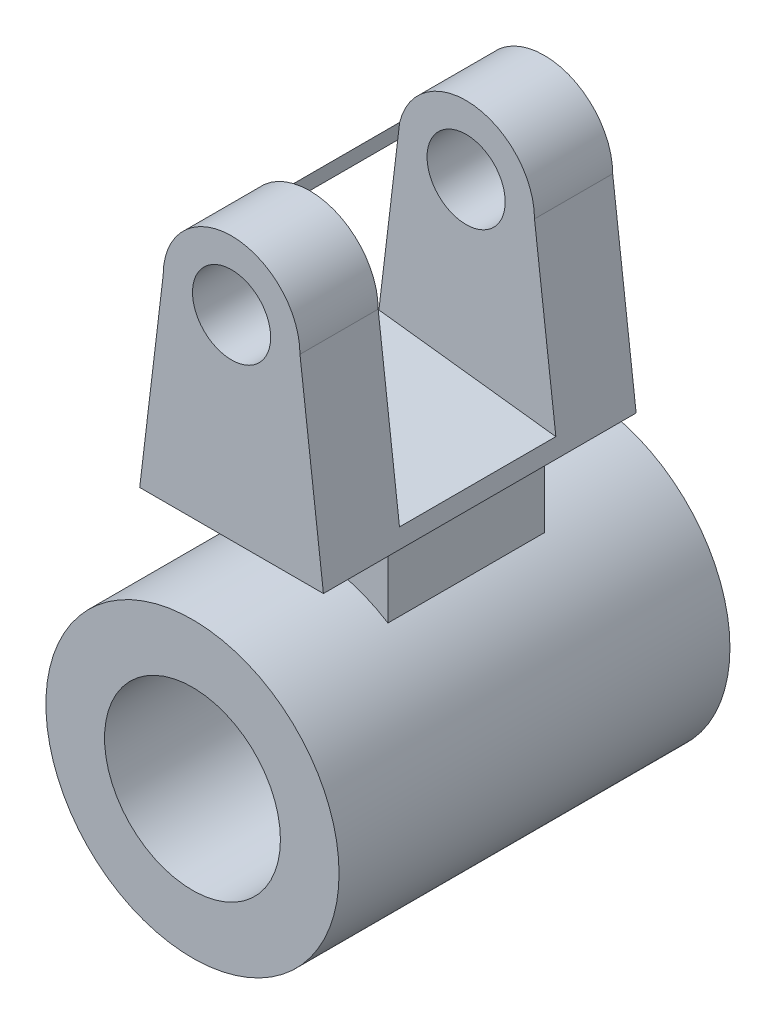
ISO-10303-21;
HEADER;
FILE_DESCRIPTION(('STEP AP214'),'2;1');
FILE_NAME('part.step','',(''),(''),'','','');
FILE_SCHEMA(('AUTOMOTIVE_DESIGN { 1 0 10303 214 1 1 1 1 }'));
ENDSEC;
DATA;
#1=APPLICATION_CONTEXT('core data for automotive mechanical design processes');
#2=APPLICATION_PROTOCOL_DEFINITION('international standard','automotive_design',2000,#1);
#3=PRODUCT_CONTEXT('',#1,'mechanical');
#4=PRODUCT('Part','Part','',(#3));
#5=PRODUCT_RELATED_PRODUCT_CATEGORY('part','',(#4));
#6=PRODUCT_DEFINITION_FORMATION('','',#4);
#7=PRODUCT_DEFINITION_CONTEXT('part definition',#1,'design');
#8=PRODUCT_DEFINITION('design','',#6,#7);
#9=PRODUCT_DEFINITION_SHAPE('','',#8);
#10=(LENGTH_UNIT() NAMED_UNIT(*) SI_UNIT(.MILLI.,.METRE.));
#11=(NAMED_UNIT(*) PLANE_ANGLE_UNIT() SI_UNIT($,.RADIAN.));
#12=(NAMED_UNIT(*) SI_UNIT($,.STERADIAN.) SOLID_ANGLE_UNIT());
#13=UNCERTAINTY_MEASURE_WITH_UNIT(LENGTH_MEASURE(1.E-05),#10,'distance_accuracy_value','');
#14=(GEOMETRIC_REPRESENTATION_CONTEXT(3) GLOBAL_UNCERTAINTY_ASSIGNED_CONTEXT((#13)) GLOBAL_UNIT_ASSIGNED_CONTEXT((#10,
#11,#12)) REPRESENTATION_CONTEXT('',''));
#15=CARTESIAN_POINT('',(0.,0.,0.));
#16=DIRECTION('',(0.,0.,1.));
#17=DIRECTION('',(1.,0.,0.));
#18=AXIS2_PLACEMENT_3D('',#15,#16,#17);
#19=CARTESIAN_POINT('',(0.,0.,50.));
#20=DIRECTION('',(0.,0.,1.));
#21=DIRECTION('',(1.,0.,0.));
#22=AXIS2_PLACEMENT_3D('',#19,#20,#21);
#23=PLANE('',#22);
#24=CARTESIAN_POINT('',(0.,0.,50.));
#25=DIRECTION('',(0.,0.,1.));
#26=DIRECTION('',(1.,0.,0.));
#27=AXIS2_PLACEMENT_3D('',#24,#25,#26);
#28=CIRCLE('',#27,37.5);
#29=CARTESIAN_POINT('',(37.5,0.,50.));
#30=VERTEX_POINT('',#29);
#31=EDGE_CURVE('E241',#30,#30,#28,.T.);
#32=ORIENTED_EDGE('',*,*,#31,.T.);
#33=EDGE_LOOP('',(#32));
#34=FACE_BOUND('',#33,.T.);
#35=CARTESIAN_POINT('',(0.,0.,50.));
#36=DIRECTION('',(0.,0.,1.));
#37=DIRECTION('',(1.,0.,0.));
#38=AXIS2_PLACEMENT_3D('',#35,#36,#37);
#39=CIRCLE('',#38,22.5);
#40=CARTESIAN_POINT('',(22.5,0.,50.));
#41=VERTEX_POINT('',#40);
#42=EDGE_CURVE('E235',#41,#41,#39,.T.);
#43=ORIENTED_EDGE('',*,*,#42,.F.);
#44=EDGE_LOOP('',(#43));
#45=FACE_BOUND('',#44,.T.);
#46=ADVANCED_FACE('F33',(#34,#45),#23,.T.);
#47=CARTESIAN_POINT('',(0.,0.,-50.));
#48=DIRECTION('',(0.,0.,1.));
#49=DIRECTION('',(1.,0.,0.));
#50=AXIS2_PLACEMENT_3D('',#47,#48,#49);
#51=PLANE('',#50);
#52=CARTESIAN_POINT('',(0.,0.,-50.));
#53=DIRECTION('',(0.,0.,1.));
#54=DIRECTION('',(1.,0.,0.));
#55=AXIS2_PLACEMENT_3D('',#52,#53,#54);
#56=CIRCLE('',#55,37.5);
#57=CARTESIAN_POINT('',(37.5,0.,-50.));
#58=VERTEX_POINT('',#57);
#59=EDGE_CURVE('E238',#58,#58,#56,.T.);
#60=ORIENTED_EDGE('',*,*,#59,.F.);
#61=EDGE_LOOP('',(#60));
#62=FACE_BOUND('',#61,.T.);
#63=CARTESIAN_POINT('',(0.,0.,-50.));
#64=DIRECTION('',(0.,0.,1.));
#65=DIRECTION('',(1.,0.,0.));
#66=AXIS2_PLACEMENT_3D('',#63,#64,#65);
#67=CIRCLE('',#66,22.5);
#68=CARTESIAN_POINT('',(22.5,0.,-50.));
#69=VERTEX_POINT('',#68);
#70=EDGE_CURVE('E234',#69,#69,#67,.T.);
#71=ORIENTED_EDGE('',*,*,#70,.T.);
#72=EDGE_LOOP('',(#71));
#73=FACE_BOUND('',#72,.T.);
#74=ADVANCED_FACE('F279',(#62,#73),#51,.F.);
#75=CARTESIAN_POINT('',(0.,0.,50.));
#76=DIRECTION('',(0.,0.,-1.));
#77=DIRECTION('',(-1.,0.,0.));
#78=AXIS2_PLACEMENT_3D('',#75,#76,#77);
#79=CYLINDRICAL_SURFACE('',#78,37.5);
#80=DIRECTION('',(0.,0.,-1.));
#81=VECTOR('',#80,1.);
#82=CARTESIAN_POINT('',(20.,31.7214438511238,50.));
#83=LINE('',#82,#81);
#84=CARTESIAN_POINT('',(20.,31.7214438511238,20.));
#85=VERTEX_POINT('',#84);
#86=CARTESIAN_POINT('',(20.,31.7214438511238,-20.));
#87=VERTEX_POINT('',#86);
#88=EDGE_CURVE('E51',#85,#87,#83,.T.);
#89=ORIENTED_EDGE('',*,*,#88,.F.);
#90=CARTESIAN_POINT('',(0.,0.,20.));
#91=DIRECTION('',(0.,0.,1.));
#92=DIRECTION('',(1.,0.,0.));
#93=AXIS2_PLACEMENT_3D('',#90,#91,#92);
#94=CIRCLE('',#93,37.5);
#95=CARTESIAN_POINT('',(-20.,31.7214438511238,20.));
#96=VERTEX_POINT('',#95);
#97=EDGE_CURVE('E11',#85,#96,#94,.T.);
#98=ORIENTED_EDGE('',*,*,#97,.T.);
#99=DIRECTION('',(0.,0.,-1.));
#100=VECTOR('',#99,1.);
#101=CARTESIAN_POINT('',(-20.,31.7214438511238,50.));
#102=LINE('',#101,#100);
#103=CARTESIAN_POINT('',(-20.,31.7214438511238,-20.));
#104=VERTEX_POINT('',#103);
#105=EDGE_CURVE('E41',#104,#96,#102,.F.);
#106=ORIENTED_EDGE('',*,*,#105,.F.);
#107=CARTESIAN_POINT('',(0.,0.,-20.));
#108=DIRECTION('',(0.,0.,1.));
#109=DIRECTION('',(1.,0.,0.));
#110=AXIS2_PLACEMENT_3D('',#107,#108,#109);
#111=CIRCLE('',#110,37.5);
#112=EDGE_CURVE('E244',#87,#104,#111,.T.);
#113=ORIENTED_EDGE('',*,*,#112,.F.);
#114=EDGE_LOOP('',(#89,#98,#106,#113));
#115=FACE_BOUND('',#114,.T.);
#116=ORIENTED_EDGE('',*,*,#31,.F.);
#117=EDGE_LOOP('',(#116));
#118=FACE_BOUND('',#117,.T.);
#119=ORIENTED_EDGE('',*,*,#59,.T.);
#120=EDGE_LOOP('',(#119));
#121=FACE_BOUND('',#120,.T.);
#122=ADVANCED_FACE('F35',(#115,#118,#121),#79,.T.);
#123=CARTESIAN_POINT('',(0.,0.,50.));
#124=DIRECTION('',(0.,0.,-1.));
#125=DIRECTION('',(-1.,0.,0.));
#126=AXIS2_PLACEMENT_3D('',#123,#124,#125);
#127=CYLINDRICAL_SURFACE('',#126,22.5);
#128=ORIENTED_EDGE('',*,*,#42,.T.);
#129=EDGE_LOOP('',(#128));
#130=FACE_BOUND('',#129,.T.);
#131=ORIENTED_EDGE('',*,*,#70,.F.);
#132=EDGE_LOOP('',(#131));
#133=FACE_BOUND('',#132,.T.);
#134=ADVANCED_FACE('F275',(#130,#133),#127,.F.);
#135=CARTESIAN_POINT('',(-20.,50.,20.));
#136=DIRECTION('',(1.,0.,0.));
#137=DIRECTION('',(0.,1.,0.));
#138=AXIS2_PLACEMENT_3D('',#135,#136,#137);
#139=PLANE('',#138);
#140=DIRECTION('',(0.,-1.,0.));
#141=VECTOR('',#140,1.);
#142=CARTESIAN_POINT('',(-20.,50.,-20.));
#143=LINE('',#142,#141);
#144=CARTESIAN_POINT('',(-20.,50.,-20.));
#145=VERTEX_POINT('',#144);
#146=EDGE_CURVE('E213',#145,#104,#143,.T.);
#147=ORIENTED_EDGE('',*,*,#146,.T.);
#148=ORIENTED_EDGE('',*,*,#105,.T.);
#149=DIRECTION('',(0.,-1.,0.));
#150=VECTOR('',#149,1.);
#151=CARTESIAN_POINT('',(-20.,50.,20.));
#152=LINE('',#151,#150);
#153=CARTESIAN_POINT('',(-20.,50.,20.));
#154=VERTEX_POINT('',#153);
#155=EDGE_CURVE('E214',#154,#96,#152,.T.);
#156=ORIENTED_EDGE('',*,*,#155,.F.);
#157=DIRECTION('',(0.,0.,-1.));
#158=VECTOR('',#157,1.);
#159=CARTESIAN_POINT('',(-20.,50.,20.));
#160=LINE('',#159,#158);
#161=EDGE_CURVE('E222',#154,#145,#160,.T.);
#162=ORIENTED_EDGE('',*,*,#161,.T.);
#163=EDGE_LOOP('',(#147,#148,#156,#162));
#164=FACE_BOUND('',#163,.T.);
#165=ADVANCED_FACE('F251',(#164),#139,.F.);
#166=CARTESIAN_POINT('',(20.,50.,20.));
#167=DIRECTION('',(-1.,0.,0.));
#168=DIRECTION('',(0.,-1.,0.));
#169=AXIS2_PLACEMENT_3D('',#166,#167,#168);
#170=PLANE('',#169);
#171=DIRECTION('',(0.,1.,0.));
#172=VECTOR('',#171,1.);
#173=CARTESIAN_POINT('',(20.,50.,20.));
#174=LINE('',#173,#172);
#175=CARTESIAN_POINT('',(20.,50.,20.));
#176=VERTEX_POINT('',#175);
#177=EDGE_CURVE('E217',#85,#176,#174,.T.);
#178=ORIENTED_EDGE('',*,*,#177,.F.);
#179=ORIENTED_EDGE('',*,*,#88,.T.);
#180=DIRECTION('',(0.,1.,0.));
#181=VECTOR('',#180,1.);
#182=CARTESIAN_POINT('',(20.,50.,-20.));
#183=LINE('',#182,#181);
#184=CARTESIAN_POINT('',(20.,50.,-20.));
#185=VERTEX_POINT('',#184);
#186=EDGE_CURVE('E225',#87,#185,#183,.T.);
#187=ORIENTED_EDGE('',*,*,#186,.T.);
#188=DIRECTION('',(0.,0.,-1.));
#189=VECTOR('',#188,1.);
#190=CARTESIAN_POINT('',(20.,50.,20.));
#191=LINE('',#190,#189);
#192=EDGE_CURVE('E231',#176,#185,#191,.T.);
#193=ORIENTED_EDGE('',*,*,#192,.F.);
#194=EDGE_LOOP('',(#178,#179,#187,#193));
#195=FACE_BOUND('',#194,.T.);
#196=ADVANCED_FACE('F267',(#195),#170,.F.);
#197=CARTESIAN_POINT('',(0.,0.,20.));
#198=DIRECTION('',(0.,0.,1.));
#199=DIRECTION('',(1.,0.,0.));
#200=AXIS2_PLACEMENT_3D('',#197,#198,#199);
#201=PLANE('',#200);
#202=ORIENTED_EDGE('',*,*,#97,.F.);
#203=ORIENTED_EDGE('',*,*,#177,.T.);
#204=DIRECTION('',(-1.,0.,0.));
#205=VECTOR('',#204,1.);
#206=CARTESIAN_POINT('',(-20.,50.,20.));
#207=LINE('',#206,#205);
#208=EDGE_CURVE('E220',#176,#154,#207,.T.);
#209=ORIENTED_EDGE('',*,*,#208,.T.);
#210=ORIENTED_EDGE('',*,*,#155,.T.);
#211=EDGE_LOOP('',(#202,#203,#209,#210));
#212=FACE_BOUND('',#211,.T.);
#213=ADVANCED_FACE('F254',(#212),#201,.T.);
#214=CARTESIAN_POINT('',(0.,0.,-20.));
#215=DIRECTION('',(0.,0.,1.));
#216=DIRECTION('',(1.,0.,0.));
#217=AXIS2_PLACEMENT_3D('',#214,#215,#216);
#218=PLANE('',#217);
#219=ORIENTED_EDGE('',*,*,#186,.F.);
#220=ORIENTED_EDGE('',*,*,#112,.T.);
#221=ORIENTED_EDGE('',*,*,#146,.F.);
#222=DIRECTION('',(-1.,0.,0.));
#223=VECTOR('',#222,1.);
#224=CARTESIAN_POINT('',(-20.,50.,-20.));
#225=LINE('',#224,#223);
#226=EDGE_CURVE('E218',#185,#145,#225,.T.);
#227=ORIENTED_EDGE('',*,*,#226,.F.);
#228=EDGE_LOOP('',(#219,#220,#221,#227));
#229=FACE_BOUND('',#228,.T.);
#230=ADVANCED_FACE('F264',(#229),#218,.F.);
#231=CARTESIAN_POINT('',(0.,100.,-50.));
#232=DIRECTION('',(0.,0.,1.));
#233=DIRECTION('',(1.,0.,0.));
#234=AXIS2_PLACEMENT_3D('',#231,#232,#233);
#235=CYLINDRICAL_SURFACE('',#234,10.);
#236=CARTESIAN_POINT('',(0.,100.,-20.));
#237=DIRECTION('',(0.,0.,-1.));
#238=DIRECTION('',(0.,1.,0.));
#239=AXIS2_PLACEMENT_3D('',#236,#237,#238);
#240=CIRCLE('',#239,10.);
#241=CARTESIAN_POINT('',(0.,110.,-20.));
#242=VERTEX_POINT('',#241);
#243=EDGE_CURVE('E159',#242,#242,#240,.F.);
#244=ORIENTED_EDGE('',*,*,#243,.T.);
#245=EDGE_LOOP('',(#244));
#246=FACE_BOUND('',#245,.T.);
#247=CARTESIAN_POINT('',(0.,100.,-40.));
#248=DIRECTION('',(0.,0.,1.));
#249=DIRECTION('',(1.,0.,0.));
#250=AXIS2_PLACEMENT_3D('',#247,#248,#249);
#251=CIRCLE('',#250,10.);
#252=CARTESIAN_POINT('',(10.,100.,-40.));
#253=VERTEX_POINT('',#252);
#254=EDGE_CURVE('E168',#253,#253,#251,.T.);
#255=ORIENTED_EDGE('',*,*,#254,.F.);
#256=EDGE_LOOP('',(#255));
#257=FACE_BOUND('',#256,.T.);
#258=ADVANCED_FACE('F317',(#246,#257),#235,.F.);
#259=CARTESIAN_POINT('',(0.,100.,40.));
#260=DIRECTION('',(0.,0.,-1.));
#261=DIRECTION('',(-1.,0.,0.));
#262=AXIS2_PLACEMENT_3D('',#259,#260,#261);
#263=CYLINDRICAL_SURFACE('',#262,17.5);
#264=DIRECTION('',(0.,0.,-1.));
#265=VECTOR('',#264,1.);
#266=CARTESIAN_POINT('',(17.5,100.,40.));
#267=LINE('',#266,#265);
#268=CARTESIAN_POINT('',(17.5,100.,40.));
#269=VERTEX_POINT('',#268);
#270=CARTESIAN_POINT('',(17.5,100.,20.));
#271=VERTEX_POINT('',#270);
#272=EDGE_CURVE('E191',#269,#271,#267,.T.);
#273=ORIENTED_EDGE('',*,*,#272,.T.);
#274=CARTESIAN_POINT('',(0.,100.,20.));
#275=DIRECTION('',(0.,0.,1.));
#276=DIRECTION('',(0.,-1.,0.));
#277=AXIS2_PLACEMENT_3D('',#274,#275,#276);
#278=CIRCLE('',#277,17.5);
#279=CARTESIAN_POINT('',(-17.0031545741325,104.140378548896,20.));
#280=VERTEX_POINT('',#279);
#281=EDGE_CURVE('E157',#271,#280,#278,.T.);
#282=ORIENTED_EDGE('',*,*,#281,.T.);
#283=DIRECTION('',(0.,0.,-1.));
#284=VECTOR('',#283,1.);
#285=CARTESIAN_POINT('',(-17.0031545741326,104.140378548896,40.));
#286=LINE('',#285,#284);
#287=CARTESIAN_POINT('',(-17.0031545741325,104.140378548896,-20.));
#288=VERTEX_POINT('',#287);
#289=EDGE_CURVE('E210',#280,#288,#286,.T.);
#290=ORIENTED_EDGE('',*,*,#289,.T.);
#291=CARTESIAN_POINT('',(0.,100.,-20.));
#292=DIRECTION('',(0.,0.,-1.));
#293=DIRECTION('',(0.,1.,0.));
#294=AXIS2_PLACEMENT_3D('',#291,#292,#293);
#295=CIRCLE('',#294,17.5);
#296=CARTESIAN_POINT('',(17.5,100.,-20.));
#297=VERTEX_POINT('',#296);
#298=EDGE_CURVE('E163',#288,#297,#295,.T.);
#299=ORIENTED_EDGE('',*,*,#298,.T.);
#300=CARTESIAN_POINT('',(17.5,100.,-40.));
#301=VERTEX_POINT('',#300);
#302=EDGE_CURVE('E180',#297,#301,#267,.T.);
#303=ORIENTED_EDGE('',*,*,#302,.T.);
#304=CARTESIAN_POINT('',(0.,100.,-40.));
#305=DIRECTION('',(0.,0.,1.));
#306=DIRECTION('',(1.,0.,0.));
#307=AXIS2_PLACEMENT_3D('',#304,#305,#306);
#308=CIRCLE('',#307,17.5);
#309=CARTESIAN_POINT('',(-17.5,100.,-40.));
#310=VERTEX_POINT('',#309);
#311=EDGE_CURVE('E181',#301,#310,#308,.T.);
#312=ORIENTED_EDGE('',*,*,#311,.T.);
#313=DIRECTION('',(0.,0.,-1.));
#314=VECTOR('',#313,1.);
#315=CARTESIAN_POINT('',(-17.5,100.,40.));
#316=LINE('',#315,#314);
#317=CARTESIAN_POINT('',(-17.5,100.,-20.));
#318=VERTEX_POINT('',#317);
#319=EDGE_CURVE('E199',#318,#310,#316,.T.);
#320=ORIENTED_EDGE('',*,*,#319,.F.);
#321=CARTESIAN_POINT('',(-17.5,100.,20.));
#322=VERTEX_POINT('',#321);
#323=EDGE_CURVE('E202',#322,#318,#316,.T.);
#324=ORIENTED_EDGE('',*,*,#323,.F.);
#325=CARTESIAN_POINT('',(-17.5,100.,40.));
#326=VERTEX_POINT('',#325);
#327=EDGE_CURVE('E151',#326,#322,#316,.T.);
#328=ORIENTED_EDGE('',*,*,#327,.F.);
#329=CARTESIAN_POINT('',(0.,100.,40.));
#330=DIRECTION('',(0.,0.,1.));
#331=DIRECTION('',(1.,0.,0.));
#332=AXIS2_PLACEMENT_3D('',#329,#330,#331);
#333=CIRCLE('',#332,17.5);
#334=EDGE_CURVE('E169',#269,#326,#333,.T.);
#335=ORIENTED_EDGE('',*,*,#334,.F.);
#336=EDGE_LOOP('',(#273,#282,#290,#299,#303,#312,#320,#324,#328,#335));
#337=FACE_BOUND('',#336,.T.);
#338=ADVANCED_FACE('F323',(#337),#263,.T.);
#339=CARTESIAN_POINT('',(-17.5,100.,40.));
#340=DIRECTION('',(0.992876838486922,-0.11914522061843,0.));
#341=DIRECTION('',(0.11914522061843,0.992876838486922,0.));
#342=AXIS2_PLACEMENT_3D('',#339,#340,#341);
#343=PLANE('',#342);
#344=DIRECTION('',(0.,0.,1.));
#345=VECTOR('',#344,1.);
#346=CARTESIAN_POINT('',(-22.3085477938157,59.9287683848692,-20.));
#347=LINE('',#346,#345);
#348=CARTESIAN_POINT('',(-22.3085477938157,59.9287683848692,-20.));
#349=VERTEX_POINT('',#348);
#350=CARTESIAN_POINT('',(-22.3085477938157,59.9287683848692,20.));
#351=VERTEX_POINT('',#350);
#352=EDGE_CURVE('E140',#349,#351,#347,.T.);
#353=ORIENTED_EDGE('',*,*,#352,.F.);
#354=DIRECTION('',(-0.11914522061843,-0.992876838486922,0.));
#355=VECTOR('',#354,1.);
#356=CARTESIAN_POINT('',(-15.1665359262437,119.445533947969,-20.));
#357=LINE('',#356,#355);
#358=EDGE_CURVE('E461',#318,#349,#357,.T.);
#359=ORIENTED_EDGE('',*,*,#358,.F.);
#360=ORIENTED_EDGE('',*,*,#319,.T.);
#361=DIRECTION('',(-0.11914522061843,-0.992876838486922,0.));
#362=VECTOR('',#361,1.);
#363=CARTESIAN_POINT('',(-17.5,100.,-40.));
#364=LINE('',#363,#362);
#365=CARTESIAN_POINT('',(-23.5,50.,-40.));
#366=VERTEX_POINT('',#365);
#367=EDGE_CURVE('E184',#310,#366,#364,.T.);
#368=ORIENTED_EDGE('',*,*,#367,.T.);
#369=DIRECTION('',(0.,0.,-1.));
#370=VECTOR('',#369,1.);
#371=CARTESIAN_POINT('',(-23.5,50.,40.));
#372=LINE('',#371,#370);
#373=CARTESIAN_POINT('',(-23.5,50.,40.));
#374=VERTEX_POINT('',#373);
#375=EDGE_CURVE('E196',#374,#366,#372,.T.);
#376=ORIENTED_EDGE('',*,*,#375,.F.);
#377=DIRECTION('',(-0.11914522061843,-0.992876838486922,0.));
#378=VECTOR('',#377,1.);
#379=CARTESIAN_POINT('',(-17.5,100.,40.));
#380=LINE('',#379,#378);
#381=EDGE_CURVE('E172',#326,#374,#380,.T.);
#382=ORIENTED_EDGE('',*,*,#381,.F.);
#383=ORIENTED_EDGE('',*,*,#327,.T.);
#384=DIRECTION('',(0.11914522061843,0.992876838486922,0.));
#385=VECTOR('',#384,1.);
#386=CARTESIAN_POINT('',(-15.1665359262437,119.445533947969,20.));
#387=LINE('',#386,#385);
#388=EDGE_CURVE('E129',#351,#322,#387,.T.);
#389=ORIENTED_EDGE('',*,*,#388,.F.);
#390=EDGE_LOOP('',(#353,#359,#360,#368,#376,#382,#383,#389));
#391=FACE_BOUND('',#390,.T.);
#392=ADVANCED_FACE('F149',(#391),#343,.F.);
#393=CARTESIAN_POINT('',(-23.5,50.,40.));
#394=DIRECTION('',(0.,1.,0.));
#395=DIRECTION('',(0.,0.,1.));
#396=AXIS2_PLACEMENT_3D('',#393,#394,#395);
#397=PLANE('',#396);
#398=ORIENTED_EDGE('',*,*,#208,.F.);
#399=ORIENTED_EDGE('',*,*,#192,.T.);
#400=ORIENTED_EDGE('',*,*,#226,.T.);
#401=ORIENTED_EDGE('',*,*,#161,.F.);
#402=EDGE_LOOP('',(#398,#399,#400,#401));
#403=FACE_BOUND('',#402,.T.);
#404=DIRECTION('',(1.,0.,0.));
#405=VECTOR('',#404,1.);
#406=CARTESIAN_POINT('',(-23.5,50.,-40.));
#407=LINE('',#406,#405);
#408=CARTESIAN_POINT('',(23.5,50.,-40.));
#409=VERTEX_POINT('',#408);
#410=EDGE_CURVE('E186',#366,#409,#407,.T.);
#411=ORIENTED_EDGE('',*,*,#410,.T.);
#412=DIRECTION('',(0.,0.,-1.));
#413=VECTOR('',#412,1.);
#414=CARTESIAN_POINT('',(23.5,50.,40.));
#415=LINE('',#414,#413);
#416=CARTESIAN_POINT('',(23.5,50.,40.));
#417=VERTEX_POINT('',#416);
#418=EDGE_CURVE('E194',#417,#409,#415,.T.);
#419=ORIENTED_EDGE('',*,*,#418,.F.);
#420=DIRECTION('',(1.,0.,0.));
#421=VECTOR('',#420,1.);
#422=CARTESIAN_POINT('',(-23.5,50.,40.));
#423=LINE('',#422,#421);
#424=EDGE_CURVE('E175',#374,#417,#423,.T.);
#425=ORIENTED_EDGE('',*,*,#424,.F.);
#426=ORIENTED_EDGE('',*,*,#375,.T.);
#427=EDGE_LOOP('',(#411,#419,#425,#426));
#428=FACE_BOUND('',#427,.T.);
#429=ADVANCED_FACE('F259',(#403,#428),#397,.F.);
#430=CARTESIAN_POINT('',(17.5,100.,40.));
#431=DIRECTION('',(0.992876838486922,0.119145220618431,0.));
#432=DIRECTION('',(-0.119145220618431,0.992876838486922,0.));
#433=AXIS2_PLACEMENT_3D('',#430,#431,#432);
#434=PLANE('',#433);
#435=DIRECTION('',(-0.119145220618431,0.992876838486922,0.));
#436=VECTOR('',#435,1.);
#437=CARTESIAN_POINT('',(17.5,100.,-20.));
#438=LINE('',#437,#436);
#439=CARTESIAN_POINT('',(22.960420943635,54.4964921363752,-20.));
#440=VERTEX_POINT('',#439);
#441=EDGE_CURVE('E160',#440,#297,#438,.T.);
#442=ORIENTED_EDGE('',*,*,#441,.F.);
#443=DIRECTION('',(0.,0.,-1.));
#444=VECTOR('',#443,1.);
#445=CARTESIAN_POINT('',(22.960420943635,54.4964921363752,40.));
#446=LINE('',#445,#444);
#447=CARTESIAN_POINT('',(22.960420943635,54.4964921363752,20.));
#448=VERTEX_POINT('',#447);
#449=EDGE_CURVE('E201',#448,#440,#446,.T.);
#450=ORIENTED_EDGE('',*,*,#449,.F.);
#451=DIRECTION('',(0.119145220618431,-0.992876838486922,0.));
#452=VECTOR('',#451,1.);
#453=CARTESIAN_POINT('',(17.5,100.,20.));
#454=LINE('',#453,#452);
#455=EDGE_CURVE('E132',#271,#448,#454,.T.);
#456=ORIENTED_EDGE('',*,*,#455,.F.);
#457=ORIENTED_EDGE('',*,*,#272,.F.);
#458=DIRECTION('',(0.119145220618431,-0.992876838486922,0.));
#459=VECTOR('',#458,1.);
#460=CARTESIAN_POINT('',(17.5,100.,40.));
#461=LINE('',#460,#459);
#462=EDGE_CURVE('E177',#269,#417,#461,.T.);
#463=ORIENTED_EDGE('',*,*,#462,.T.);
#464=ORIENTED_EDGE('',*,*,#418,.T.);
#465=DIRECTION('',(0.119145220618431,-0.992876838486922,0.));
#466=VECTOR('',#465,1.);
#467=CARTESIAN_POINT('',(17.5,100.,-40.));
#468=LINE('',#467,#466);
#469=EDGE_CURVE('E173',#301,#409,#468,.T.);
#470=ORIENTED_EDGE('',*,*,#469,.F.);
#471=ORIENTED_EDGE('',*,*,#302,.F.);
#472=EDGE_LOOP('',(#442,#450,#456,#457,#463,#464,#470,#471));
#473=FACE_BOUND('',#472,.T.);
#474=ADVANCED_FACE('F349',(#473),#434,.T.);
#475=CARTESIAN_POINT('',(0.,100.,40.));
#476=DIRECTION('',(0.,0.,1.));
#477=DIRECTION('',(1.,0.,0.));
#478=AXIS2_PLACEMENT_3D('',#475,#476,#477);
#479=PLANE('',#478);
#480=CARTESIAN_POINT('',(0.,100.,40.));
#481=DIRECTION('',(0.,0.,1.));
#482=DIRECTION('',(1.,0.,0.));
#483=AXIS2_PLACEMENT_3D('',#480,#481,#482);
#484=CIRCLE('',#483,10.);
#485=CARTESIAN_POINT('',(10.,100.,40.));
#486=VERTEX_POINT('',#485);
#487=EDGE_CURVE('E165',#486,#486,#484,.T.);
#488=ORIENTED_EDGE('',*,*,#487,.F.);
#489=EDGE_LOOP('',(#488));
#490=FACE_BOUND('',#489,.T.);
#491=ORIENTED_EDGE('',*,*,#334,.T.);
#492=ORIENTED_EDGE('',*,*,#381,.T.);
#493=ORIENTED_EDGE('',*,*,#424,.T.);
#494=ORIENTED_EDGE('',*,*,#462,.F.);
#495=EDGE_LOOP('',(#491,#492,#493,#494));
#496=FACE_BOUND('',#495,.T.);
#497=ADVANCED_FACE('F357',(#490,#496),#479,.T.);
#498=CARTESIAN_POINT('',(0.,100.,-40.));
#499=DIRECTION('',(0.,0.,1.));
#500=DIRECTION('',(1.,0.,0.));
#501=AXIS2_PLACEMENT_3D('',#498,#499,#500);
#502=PLANE('',#501);
#503=ORIENTED_EDGE('',*,*,#254,.T.);
#504=EDGE_LOOP('',(#503));
#505=FACE_BOUND('',#504,.T.);
#506=ORIENTED_EDGE('',*,*,#311,.F.);
#507=ORIENTED_EDGE('',*,*,#469,.T.);
#508=ORIENTED_EDGE('',*,*,#410,.F.);
#509=ORIENTED_EDGE('',*,*,#367,.F.);
#510=EDGE_LOOP('',(#506,#507,#508,#509));
#511=FACE_BOUND('',#510,.T.);
#512=ADVANCED_FACE('F366',(#505,#511),#502,.F.);
#513=CARTESIAN_POINT('',(0.,100.,20.));
#514=DIRECTION('',(0.,0.,1.));
#515=DIRECTION('',(0.,-1.,0.));
#516=AXIS2_PLACEMENT_3D('',#513,#514,#515);
#517=CIRCLE('',#516,10.);
#518=CARTESIAN_POINT('',(0.,90.,20.));
#519=VERTEX_POINT('',#518);
#520=EDGE_CURVE('E135',#519,#519,#517,.F.);
#521=ORIENTED_EDGE('',*,*,#520,.T.);
#522=EDGE_LOOP('',(#521));
#523=FACE_BOUND('',#522,.T.);
#524=ORIENTED_EDGE('',*,*,#487,.T.);
#525=EDGE_LOOP('',(#524));
#526=FACE_BOUND('',#525,.T.);
#527=ADVANCED_FACE('F326',(#523,#526),#235,.F.);
#528=CARTESIAN_POINT('',(-29.0812302839117,3.48974763406939,0.));
#529=DIRECTION('',(-0.992876838486922,0.11914522061843,0.));
#530=DIRECTION('',(-0.11914522061843,-0.992876838486922,0.));
#531=AXIS2_PLACEMENT_3D('',#528,#529,#530);
#532=PLANE('',#531);
#533=EDGE_CURVE('E145',#322,#280,#387,.T.);
#534=ORIENTED_EDGE('',*,*,#533,.F.);
#535=ORIENTED_EDGE('',*,*,#323,.T.);
#536=EDGE_CURVE('E146',#288,#318,#357,.T.);
#537=ORIENTED_EDGE('',*,*,#536,.F.);
#538=ORIENTED_EDGE('',*,*,#289,.F.);
#539=EDGE_LOOP('',(#534,#535,#537,#538));
#540=FACE_BOUND('',#539,.T.);
#541=ADVANCED_FACE('F383',(#540),#532,.F.);
#542=CARTESIAN_POINT('',(55.3184798466269,110.987332055225,-20.));
#543=DIRECTION('',(0.,0.,-1.));
#544=DIRECTION('',(0.,1.,0.));
#545=AXIS2_PLACEMENT_3D('',#542,#543,#544);
#546=PLANE('',#545);
#547=ORIENTED_EDGE('',*,*,#243,.F.);
#548=EDGE_LOOP('',(#547));
#549=FACE_BOUND('',#548,.T.);
#550=ORIENTED_EDGE('',*,*,#536,.T.);
#551=ORIENTED_EDGE('',*,*,#358,.T.);
#552=DIRECTION('',(-0.992876838486922,0.11914522061843,0.));
#553=VECTOR('',#552,1.);
#554=CARTESIAN_POINT('',(48.176467979055,51.4705664921248,-20.));
#555=LINE('',#554,#553);
#556=EDGE_CURVE('E136',#440,#349,#555,.T.);
#557=ORIENTED_EDGE('',*,*,#556,.F.);
#558=ORIENTED_EDGE('',*,*,#441,.T.);
#559=ORIENTED_EDGE('',*,*,#298,.F.);
#560=EDGE_LOOP('',(#550,#551,#557,#558,#559));
#561=FACE_BOUND('',#560,.T.);
#562=ADVANCED_FACE('F391',(#549,#561),#546,.F.);
#563=CARTESIAN_POINT('',(55.3184798466269,110.987332055225,20.));
#564=DIRECTION('',(0.,0.,1.));
#565=DIRECTION('',(0.,-1.,0.));
#566=AXIS2_PLACEMENT_3D('',#563,#564,#565);
#567=PLANE('',#566);
#568=ORIENTED_EDGE('',*,*,#520,.F.);
#569=EDGE_LOOP('',(#568));
#570=FACE_BOUND('',#569,.T.);
#571=ORIENTED_EDGE('',*,*,#281,.F.);
#572=ORIENTED_EDGE('',*,*,#455,.T.);
#573=DIRECTION('',(-0.992876838486922,0.11914522061843,0.));
#574=VECTOR('',#573,1.);
#575=CARTESIAN_POINT('',(48.176467979055,51.4705664921248,20.));
#576=LINE('',#575,#574);
#577=EDGE_CURVE('E124',#448,#351,#576,.T.);
#578=ORIENTED_EDGE('',*,*,#577,.T.);
#579=ORIENTED_EDGE('',*,*,#388,.T.);
#580=ORIENTED_EDGE('',*,*,#533,.T.);
#581=EDGE_LOOP('',(#571,#572,#578,#579,#580));
#582=FACE_BOUND('',#581,.T.);
#583=ADVANCED_FACE('F126',(#570,#582),#567,.F.);
#584=CARTESIAN_POINT('',(48.176467979055,51.4705664921248,-20.));
#585=DIRECTION('',(-0.11914522061843,-0.992876838486922,0.));
#586=DIRECTION('',(0.992876838486922,-0.11914522061843,0.));
#587=AXIS2_PLACEMENT_3D('',#584,#585,#586);
#588=PLANE('',#587);
#589=ORIENTED_EDGE('',*,*,#449,.T.);
#590=ORIENTED_EDGE('',*,*,#556,.T.);
#591=ORIENTED_EDGE('',*,*,#352,.T.);
#592=ORIENTED_EDGE('',*,*,#577,.F.);
#593=EDGE_LOOP('',(#589,#590,#591,#592));
#594=FACE_BOUND('',#593,.T.);
#595=ADVANCED_FACE('F141',(#594),#588,.F.);
#596=CLOSED_SHELL('',(#46,#74,#122,#134,#165,#196,#213,#230,#258,#338,#392,#429,#474,#497,#512,
#527,#541,#562,#583,#595));
#597=MANIFOLD_SOLID_BREP('B2',#596);
#598=ADVANCED_BREP_SHAPE_REPRESENTATION('',(#18,#597),#14);
#599=SHAPE_DEFINITION_REPRESENTATION(#9,#598);
ENDSEC;
END-ISO-10303-21;
